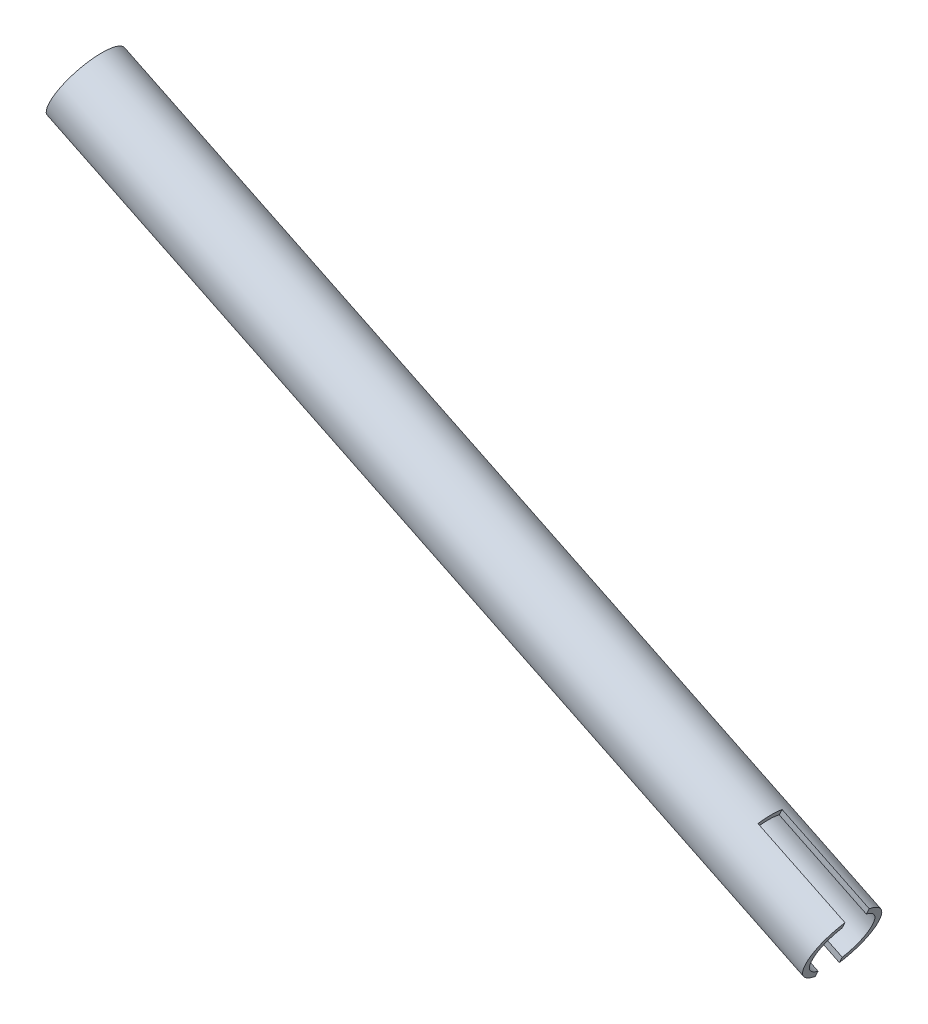
ISO-10303-21;
HEADER;
FILE_DESCRIPTION(('STEP AP214'),'2;1');
FILE_NAME('part.step','',(''),(''),'','','');
FILE_SCHEMA(('AUTOMOTIVE_DESIGN { 1 0 10303 214 1 1 1 1 }'));
ENDSEC;
DATA;
#1=APPLICATION_CONTEXT('core data for automotive mechanical design processes');
#2=APPLICATION_PROTOCOL_DEFINITION('international standard','automotive_design',2000,#1);
#3=PRODUCT_CONTEXT('',#1,'mechanical');
#4=PRODUCT('Part','Part','',(#3));
#5=PRODUCT_RELATED_PRODUCT_CATEGORY('part','',(#4));
#6=PRODUCT_DEFINITION_FORMATION('','',#4);
#7=PRODUCT_DEFINITION_CONTEXT('part definition',#1,'design');
#8=PRODUCT_DEFINITION('design','',#6,#7);
#9=PRODUCT_DEFINITION_SHAPE('','',#8);
#10=(LENGTH_UNIT() NAMED_UNIT(*) SI_UNIT(.MILLI.,.METRE.));
#11=(NAMED_UNIT(*) PLANE_ANGLE_UNIT() SI_UNIT($,.RADIAN.));
#12=(NAMED_UNIT(*) SI_UNIT($,.STERADIAN.) SOLID_ANGLE_UNIT());
#13=UNCERTAINTY_MEASURE_WITH_UNIT(LENGTH_MEASURE(1.E-05),#10,'distance_accuracy_value','');
#14=(GEOMETRIC_REPRESENTATION_CONTEXT(3) GLOBAL_UNCERTAINTY_ASSIGNED_CONTEXT((#13)) GLOBAL_UNIT_ASSIGNED_CONTEXT((#10,
#11,#12)) REPRESENTATION_CONTEXT('',''));
#15=CARTESIAN_POINT('',(0.,0.,0.));
#16=DIRECTION('',(0.,0.,1.));
#17=DIRECTION('',(1.,0.,0.));
#18=AXIS2_PLACEMENT_3D('',#15,#16,#17);
#19=CARTESIAN_POINT('',(549.918417614631,44.82518769297,0.));
#20=DIRECTION('',(-0.899365549630841,0.437197447541972,0.));
#21=DIRECTION('',(-0.437197447541972,-0.899365549630841,0.));
#22=AXIS2_PLACEMENT_3D('',#19,#20,#21);
#23=CYLINDRICAL_SURFACE('',#22,7.87399999999983);
#24=CARTESIAN_POINT('',(372.884654606769,130.88442061284,0.));
#25=DIRECTION('',(-0.899365549630841,0.437197447541972,0.));
#26=DIRECTION('',(-0.437197447541972,-0.899365549630841,0.));
#27=AXIS2_PLACEMENT_3D('',#24,#25,#26);
#28=CIRCLE('',#27,7.87399999999962);
#29=CARTESIAN_POINT('',(369.442161904823,123.802816275047,0.));
#30=VERTEX_POINT('',#29);
#31=EDGE_CURVE('E131',#30,#30,#28,.T.);
#32=ORIENTED_EDGE('',*,*,#31,.T.);
#33=EDGE_LOOP('',(#32));
#34=FACE_BOUND('',#33,.T.);
#35=CARTESIAN_POINT('',(571.3072034076,34.4277218810471,0.));
#36=DIRECTION('',(-0.899365549630841,0.437197447541972,0.));
#37=DIRECTION('',(-0.437197447541972,-0.899365549630841,0.));
#38=AXIS2_PLACEMENT_3D('',#35,#36,#37);
#39=CIRCLE('',#38,7.87400000000001);
#40=CARTESIAN_POINT('',(574.457430245372,40.9081016438835,-3.175));
#41=VERTEX_POINT('',#40);
#42=CARTESIAN_POINT('',(568.156976569827,27.9473421182106,-3.175));
#43=VERTEX_POINT('',#42);
#44=EDGE_CURVE('E132',#41,#43,#39,.T.);
#45=ORIENTED_EDGE('',*,*,#44,.F.);
#46=DIRECTION('',(-0.899365549630841,0.437197447541972,0.));
#47=VECTOR('',#46,1.);
#48=CARTESIAN_POINT('',(553.068644452403,51.3055674558063,-3.175));
#49=LINE('',#48,#47);
#50=CARTESIAN_POINT('',(551.613545284749,52.0129168114491,-3.175));
#51=VERTEX_POINT('',#50);
#52=EDGE_CURVE('E116',#41,#51,#49,.T.);
#53=ORIENTED_EDGE('',*,*,#52,.T.);
#54=CARTESIAN_POINT('',(548.463318446977,45.5325370486129,0.));
#55=DIRECTION('',(-0.89936554963084,0.437197447541975,0.));
#56=DIRECTION('',(-0.437197447541975,-0.89936554963084,0.));
#57=AXIS2_PLACEMENT_3D('',#54,#55,#56);
#58=CIRCLE('',#57,7.87399999999983);
#59=CARTESIAN_POINT('',(551.613545284749,52.0129168114491,3.175));
#60=VERTEX_POINT('',#59);
#61=EDGE_CURVE('E109',#60,#51,#58,.T.);
#62=ORIENTED_EDGE('',*,*,#61,.F.);
#63=DIRECTION('',(-0.899365549630841,0.437197447541972,0.));
#64=VECTOR('',#63,1.);
#65=CARTESIAN_POINT('',(553.068644452403,51.3055674558063,3.175));
#66=LINE('',#65,#64);
#67=CARTESIAN_POINT('',(574.457430245372,40.9081016438835,3.175));
#68=VERTEX_POINT('',#67);
#69=EDGE_CURVE('E95',#68,#60,#66,.T.);
#70=ORIENTED_EDGE('',*,*,#69,.F.);
#71=CARTESIAN_POINT('',(568.156976569827,27.9473421182106,3.175));
#72=VERTEX_POINT('',#71);
#73=EDGE_CURVE('E129',#72,#68,#39,.T.);
#74=ORIENTED_EDGE('',*,*,#73,.F.);
#75=DIRECTION('',(-0.899365549630841,0.437197447541972,0.));
#76=VECTOR('',#75,1.);
#77=CARTESIAN_POINT('',(546.768190776859,38.3448079301337,3.175));
#78=LINE('',#77,#76);
#79=CARTESIAN_POINT('',(545.313091609205,39.0521572857766,3.175));
#80=VERTEX_POINT('',#79);
#81=EDGE_CURVE('E104',#80,#72,#78,.F.);
#82=ORIENTED_EDGE('',*,*,#81,.F.);
#83=CARTESIAN_POINT('',(545.313091609205,39.0521572857766,-3.175));
#84=VERTEX_POINT('',#83);
#85=EDGE_CURVE('E118',#84,#80,#58,.T.);
#86=ORIENTED_EDGE('',*,*,#85,.F.);
#87=DIRECTION('',(-0.899365549630841,0.437197447541972,0.));
#88=VECTOR('',#87,1.);
#89=CARTESIAN_POINT('',(546.768190776859,38.3448079301337,-3.175));
#90=LINE('',#89,#88);
#91=EDGE_CURVE('E103',#84,#43,#90,.F.);
#92=ORIENTED_EDGE('',*,*,#91,.T.);
#93=EDGE_LOOP('',(#45,#53,#62,#70,#74,#82,#86,#92));
#94=FACE_BOUND('',#93,.T.);
#95=ADVANCED_FACE('F32',(#34,#94),#23,.F.);
#96=CARTESIAN_POINT('',(567.864710705654,27.3461175432539,0.));
#97=DIRECTION('',(0.899365549630841,-0.437197447541972,0.));
#98=DIRECTION('',(0.437197447541972,0.899365549630841,0.));
#99=AXIS2_PLACEMENT_3D('',#96,#97,#98);
#100=PLANE('',#99);
#101=CARTESIAN_POINT('',(571.307203407599,34.4277218810471,0.));
#102=DIRECTION('',(-0.899365549630841,0.437197447541972,0.));
#103=DIRECTION('',(-0.437197447541972,-0.899365549630841,0.));
#104=AXIS2_PLACEMENT_3D('',#101,#102,#103);
#105=CIRCLE('',#104,9.52500000000011);
#106=CARTESIAN_POINT('',(575.233348462004,42.5042548631981,-3.175));
#107=VERTEX_POINT('',#106);
#108=CARTESIAN_POINT('',(567.381058353195,26.3511888988961,-3.175));
#109=VERTEX_POINT('',#108);
#110=EDGE_CURVE('E121',#107,#109,#105,.T.);
#111=ORIENTED_EDGE('',*,*,#110,.F.);
#112=DIRECTION('',(-0.43719744754197,-0.899365549630842,0.));
#113=VECTOR('',#112,1.);
#114=CARTESIAN_POINT('',(575.471509095437,42.9941787412807,-3.175));
#115=LINE('',#114,#113);
#116=EDGE_CURVE('E157',#107,#41,#115,.T.);
#117=ORIENTED_EDGE('',*,*,#116,.T.);
#118=ORIENTED_EDGE('',*,*,#44,.T.);
#119=EDGE_CURVE('E156',#43,#109,#115,.T.);
#120=ORIENTED_EDGE('',*,*,#119,.T.);
#121=EDGE_LOOP('',(#111,#117,#118,#120));
#122=FACE_BOUND('',#121,.T.);
#123=ADVANCED_FACE('F155',(#122),#100,.T.);
#124=CARTESIAN_POINT('',(549.918417614631,44.82518769297,0.));
#125=DIRECTION('',(-0.899365549630841,0.437197447541972,0.));
#126=DIRECTION('',(-0.437197447541972,-0.899365549630841,0.));
#127=AXIS2_PLACEMENT_3D('',#124,#125,#126);
#128=CYLINDRICAL_SURFACE('',#127,9.5249999999999);
#129=CARTESIAN_POINT('',(372.884654606769,130.88442061284,0.));
#130=DIRECTION('',(-0.899365549630841,0.437197447541972,0.));
#131=DIRECTION('',(-0.437197447541972,-0.899365549630841,0.));
#132=AXIS2_PLACEMENT_3D('',#129,#130,#131);
#133=CIRCLE('',#132,9.52499999999969);
#134=CARTESIAN_POINT('',(368.720348918932,122.317963752607,0.));
#135=VERTEX_POINT('',#134);
#136=EDGE_CURVE('E117',#135,#135,#133,.T.);
#137=ORIENTED_EDGE('',*,*,#136,.F.);
#138=EDGE_LOOP('',(#137));
#139=FACE_BOUND('',#138,.T.);
#140=CARTESIAN_POINT('',(548.463318446977,45.5325370486129,0.));
#141=DIRECTION('',(-0.89936554963084,0.437197447541975,0.));
#142=DIRECTION('',(-0.437197447541975,-0.89936554963084,0.));
#143=AXIS2_PLACEMENT_3D('',#140,#141,#142);
#144=CIRCLE('',#143,9.5249999999999);
#145=CARTESIAN_POINT('',(552.389463501381,53.6090700307639,-3.175));
#146=VERTEX_POINT('',#145);
#147=CARTESIAN_POINT('',(552.389463501381,53.6090700307639,3.175));
#148=VERTEX_POINT('',#147);
#149=EDGE_CURVE('E40',#146,#148,#144,.F.);
#150=ORIENTED_EDGE('',*,*,#149,.F.);
#151=DIRECTION('',(-0.899365549630841,0.437197447541972,0.));
#152=VECTOR('',#151,1.);
#153=CARTESIAN_POINT('',(553.844562669035,52.901720675121,-3.175));
#154=LINE('',#153,#152);
#155=EDGE_CURVE('E11',#146,#107,#154,.F.);
#156=ORIENTED_EDGE('',*,*,#155,.T.);
#157=ORIENTED_EDGE('',*,*,#110,.T.);
#158=DIRECTION('',(-0.899365549630841,0.437197447541972,0.));
#159=VECTOR('',#158,1.);
#160=CARTESIAN_POINT('',(545.992272560226,36.748654710819,-3.175));
#161=LINE('',#160,#159);
#162=CARTESIAN_POINT('',(544.537173392572,37.4560040664619,-3.175));
#163=VERTEX_POINT('',#162);
#164=EDGE_CURVE('E139',#109,#163,#161,.T.);
#165=ORIENTED_EDGE('',*,*,#164,.T.);
#166=CARTESIAN_POINT('',(544.537173392572,37.4560040664619,3.175));
#167=VERTEX_POINT('',#166);
#168=EDGE_CURVE('E137',#167,#163,#144,.F.);
#169=ORIENTED_EDGE('',*,*,#168,.F.);
#170=DIRECTION('',(-0.899365549630841,0.437197447541972,0.));
#171=VECTOR('',#170,1.);
#172=CARTESIAN_POINT('',(545.992272560226,36.748654710819,3.175));
#173=LINE('',#172,#171);
#174=CARTESIAN_POINT('',(567.381058353195,26.3511888988961,3.175));
#175=VERTEX_POINT('',#174);
#176=EDGE_CURVE('E135',#175,#167,#173,.T.);
#177=ORIENTED_EDGE('',*,*,#176,.F.);
#178=CARTESIAN_POINT('',(575.233348462004,42.5042548631981,3.175));
#179=VERTEX_POINT('',#178);
#180=EDGE_CURVE('E128',#175,#179,#105,.T.);
#181=ORIENTED_EDGE('',*,*,#180,.T.);
#182=DIRECTION('',(-0.899365549630841,0.437197447541972,0.));
#183=VECTOR('',#182,1.);
#184=CARTESIAN_POINT('',(553.844562669035,52.901720675121,3.175));
#185=LINE('',#184,#183);
#186=EDGE_CURVE('E141',#148,#179,#185,.F.);
#187=ORIENTED_EDGE('',*,*,#186,.F.);
#188=EDGE_LOOP('',(#150,#156,#157,#165,#169,#177,#181,#187));
#189=FACE_BOUND('',#188,.T.);
#190=ADVANCED_FACE('F148',(#139,#189),#128,.T.);
#191=CARTESIAN_POINT('',(368.720348918932,122.317963752607,0.));
#192=DIRECTION('',(-0.899365549630841,0.437197447541972,0.));
#193=DIRECTION('',(-0.437197447541972,-0.899365549630841,0.));
#194=AXIS2_PLACEMENT_3D('',#191,#192,#193);
#195=PLANE('',#194);
#196=ORIENTED_EDGE('',*,*,#136,.T.);
#197=EDGE_LOOP('',(#196));
#198=FACE_BOUND('',#197,.T.);
#199=ORIENTED_EDGE('',*,*,#31,.F.);
#200=EDGE_LOOP('',(#199));
#201=FACE_BOUND('',#200,.T.);
#202=ADVANCED_FACE('F34',(#198,#201),#195,.T.);
#203=DIRECTION('',(0.43719744754197,0.899365549630842,0.));
#204=VECTOR('',#203,1.);
#205=CARTESIAN_POINT('',(575.471509095437,42.9941787412807,3.175));
#206=LINE('',#205,#204);
#207=EDGE_CURVE('E98',#68,#179,#206,.T.);
#208=ORIENTED_EDGE('',*,*,#207,.T.);
#209=ORIENTED_EDGE('',*,*,#180,.F.);
#210=EDGE_CURVE('E55',#175,#72,#206,.T.);
#211=ORIENTED_EDGE('',*,*,#210,.T.);
#212=ORIENTED_EDGE('',*,*,#73,.T.);
#213=EDGE_LOOP('',(#208,#209,#211,#212));
#214=FACE_BOUND('',#213,.T.);
#215=ADVANCED_FACE('F146',(#214),#100,.T.);
#216=CARTESIAN_POINT('',(0.,0.,3.175));
#217=DIRECTION('',(0.,0.,1.));
#218=DIRECTION('',(1.,0.,0.));
#219=AXIS2_PLACEMENT_3D('',#216,#217,#218);
#220=PLANE('',#219);
#221=ORIENTED_EDGE('',*,*,#81,.T.);
#222=ORIENTED_EDGE('',*,*,#210,.F.);
#223=ORIENTED_EDGE('',*,*,#176,.T.);
#224=DIRECTION('',(-0.437197447541975,-0.89936554963084,0.));
#225=VECTOR('',#224,1.);
#226=CARTESIAN_POINT('',(544.299012759139,36.9660801883792,3.175));
#227=LINE('',#226,#225);
#228=EDGE_CURVE('E112',#80,#167,#227,.T.);
#229=ORIENTED_EDGE('',*,*,#228,.F.);
#230=EDGE_LOOP('',(#221,#222,#223,#229));
#231=FACE_BOUND('',#230,.T.);
#232=ADVANCED_FACE('F175',(#231),#220,.F.);
#233=CARTESIAN_POINT('',(0.,0.,-3.175));
#234=DIRECTION('',(0.,0.,1.));
#235=DIRECTION('',(1.,0.,0.));
#236=AXIS2_PLACEMENT_3D('',#233,#234,#235);
#237=PLANE('',#236);
#238=DIRECTION('',(0.437197447541975,0.89936554963084,0.));
#239=VECTOR('',#238,1.);
#240=CARTESIAN_POINT('',(544.299012759139,36.9660801883792,-3.175));
#241=LINE('',#240,#239);
#242=EDGE_CURVE('E166',#163,#84,#241,.T.);
#243=ORIENTED_EDGE('',*,*,#242,.F.);
#244=ORIENTED_EDGE('',*,*,#164,.F.);
#245=ORIENTED_EDGE('',*,*,#119,.F.);
#246=ORIENTED_EDGE('',*,*,#91,.F.);
#247=EDGE_LOOP('',(#243,#244,#245,#246));
#248=FACE_BOUND('',#247,.T.);
#249=ADVANCED_FACE('F173',(#248),#237,.T.);
#250=CARTESIAN_POINT('',(544.299012759139,36.9660801883792,-45.2355974825671));
#251=DIRECTION('',(-0.89936554963084,0.437197447541975,0.));
#252=DIRECTION('',(-0.437197447541975,-0.89936554963084,0.));
#253=AXIS2_PLACEMENT_3D('',#250,#251,#252);
#254=PLANE('',#253);
#255=ORIENTED_EDGE('',*,*,#85,.T.);
#256=ORIENTED_EDGE('',*,*,#228,.T.);
#257=ORIENTED_EDGE('',*,*,#168,.T.);
#258=ORIENTED_EDGE('',*,*,#242,.T.);
#259=EDGE_LOOP('',(#255,#256,#257,#258));
#260=FACE_BOUND('',#259,.T.);
#261=ADVANCED_FACE('F172',(#260),#254,.F.);
#262=ORIENTED_EDGE('',*,*,#61,.T.);
#263=EDGE_CURVE('E167',#51,#146,#241,.T.);
#264=ORIENTED_EDGE('',*,*,#263,.T.);
#265=ORIENTED_EDGE('',*,*,#149,.T.);
#266=EDGE_CURVE('E47',#148,#60,#227,.T.);
#267=ORIENTED_EDGE('',*,*,#266,.T.);
#268=EDGE_LOOP('',(#262,#264,#265,#267));
#269=FACE_BOUND('',#268,.T.);
#270=ADVANCED_FACE('F107',(#269),#254,.F.);
#271=ORIENTED_EDGE('',*,*,#116,.F.);
#272=ORIENTED_EDGE('',*,*,#155,.F.);
#273=ORIENTED_EDGE('',*,*,#263,.F.);
#274=ORIENTED_EDGE('',*,*,#52,.F.);
#275=EDGE_LOOP('',(#271,#272,#273,#274));
#276=FACE_BOUND('',#275,.T.);
#277=ADVANCED_FACE('F177',(#276),#237,.T.);
#278=ORIENTED_EDGE('',*,*,#69,.T.);
#279=ORIENTED_EDGE('',*,*,#266,.F.);
#280=ORIENTED_EDGE('',*,*,#186,.T.);
#281=ORIENTED_EDGE('',*,*,#207,.F.);
#282=EDGE_LOOP('',(#278,#279,#280,#281));
#283=FACE_BOUND('',#282,.T.);
#284=ADVANCED_FACE('F96',(#283),#220,.F.);
#285=CLOSED_SHELL('',(#95,#123,#190,#202,#215,#232,#249,#261,#270,#277,#284));
#286=MANIFOLD_SOLID_BREP('B2',#285);
#287=ADVANCED_BREP_SHAPE_REPRESENTATION('',(#18,#286),#14);
#288=SHAPE_DEFINITION_REPRESENTATION(#9,#287);
ENDSEC;
END-ISO-10303-21;
